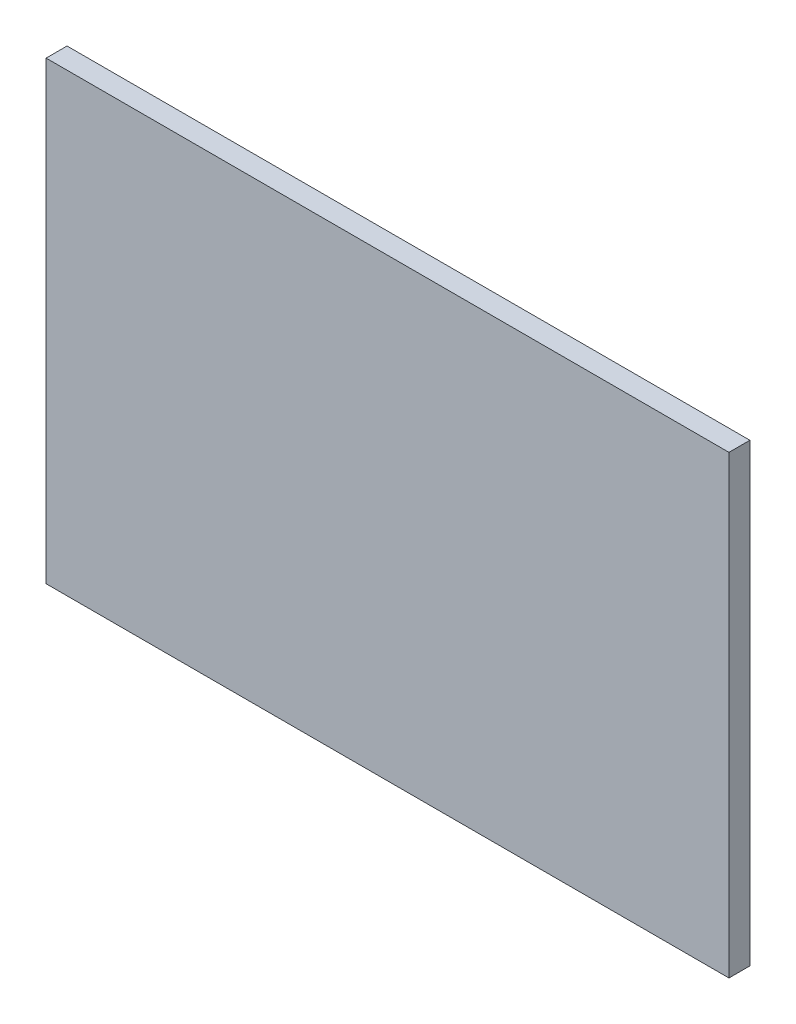
ISO-10303-21;
HEADER;
FILE_DESCRIPTION(('STEP AP214'),'2;1');
FILE_NAME('part.step','',(''),(''),'','','');
FILE_SCHEMA(('AUTOMOTIVE_DESIGN { 1 0 10303 214 1 1 1 1 }'));
ENDSEC;
DATA;
#1=APPLICATION_CONTEXT('core data for automotive mechanical design processes');
#2=APPLICATION_PROTOCOL_DEFINITION('international standard','automotive_design',2000,#1);
#3=PRODUCT_CONTEXT('',#1,'mechanical');
#4=PRODUCT('Part','Part','',(#3));
#5=PRODUCT_RELATED_PRODUCT_CATEGORY('part','',(#4));
#6=PRODUCT_DEFINITION_FORMATION('','',#4);
#7=PRODUCT_DEFINITION_CONTEXT('part definition',#1,'design');
#8=PRODUCT_DEFINITION('design','',#6,#7);
#9=PRODUCT_DEFINITION_SHAPE('','',#8);
#10=(LENGTH_UNIT() NAMED_UNIT(*) SI_UNIT(.MILLI.,.METRE.));
#11=(NAMED_UNIT(*) PLANE_ANGLE_UNIT() SI_UNIT($,.RADIAN.));
#12=(NAMED_UNIT(*) SI_UNIT($,.STERADIAN.) SOLID_ANGLE_UNIT());
#13=UNCERTAINTY_MEASURE_WITH_UNIT(LENGTH_MEASURE(1.E-05),#10,'distance_accuracy_value','');
#14=(GEOMETRIC_REPRESENTATION_CONTEXT(3) GLOBAL_UNCERTAINTY_ASSIGNED_CONTEXT((#13)) GLOBAL_UNIT_ASSIGNED_CONTEXT((#10,
#11,#12)) REPRESENTATION_CONTEXT('',''));
#15=CARTESIAN_POINT('',(0.,0.,0.));
#16=DIRECTION('',(0.,0.,1.));
#17=DIRECTION('',(1.,0.,0.));
#18=AXIS2_PLACEMENT_3D('',#15,#16,#17);
#19=CARTESIAN_POINT('',(0.,0.,0.));
#20=DIRECTION('',(0.,0.,1.));
#21=DIRECTION('',(1.,0.,0.));
#22=AXIS2_PLACEMENT_3D('',#19,#20,#21);
#23=PLANE('',#22);
#24=DIRECTION('',(1.,0.,0.));
#25=VECTOR('',#24,1.);
#26=CARTESIAN_POINT('',(179.729967884567,148.126483669053,0.));
#27=LINE('',#26,#25);
#28=CARTESIAN_POINT('',(179.729967884567,148.126483669053,0.));
#29=VERTEX_POINT('',#28);
#30=CARTESIAN_POINT('',(254.729967884567,148.126483669053,0.));
#31=VERTEX_POINT('',#30);
#32=EDGE_CURVE('E81',#29,#31,#27,.T.);
#33=ORIENTED_EDGE('',*,*,#32,.T.);
#34=DIRECTION('',(0.,1.,0.));
#35=VECTOR('',#34,1.);
#36=CARTESIAN_POINT('',(254.729967884567,148.126483669053,0.));
#37=LINE('',#36,#35);
#38=CARTESIAN_POINT('',(254.729967884567,98.1264836690532,0.));
#39=VERTEX_POINT('',#38);
#40=EDGE_CURVE('E68',#31,#39,#37,.F.);
#41=ORIENTED_EDGE('',*,*,#40,.T.);
#42=DIRECTION('',(1.,0.,0.));
#43=VECTOR('',#42,1.);
#44=CARTESIAN_POINT('',(179.729967884567,98.1264836690532,0.));
#45=LINE('',#44,#43);
#46=CARTESIAN_POINT('',(179.729967884567,98.1264836690532,0.));
#47=VERTEX_POINT('',#46);
#48=EDGE_CURVE('E55',#39,#47,#45,.F.);
#49=ORIENTED_EDGE('',*,*,#48,.T.);
#50=DIRECTION('',(0.,1.,0.));
#51=VECTOR('',#50,1.);
#52=CARTESIAN_POINT('',(179.729967884567,148.126483669053,0.));
#53=LINE('',#52,#51);
#54=EDGE_CURVE('E20',#47,#29,#53,.T.);
#55=ORIENTED_EDGE('',*,*,#54,.T.);
#56=EDGE_LOOP('',(#33,#41,#49,#55));
#57=FACE_BOUND('',#56,.T.);
#58=ADVANCED_FACE('F17',(#57),#23,.F.);
#59=CARTESIAN_POINT('',(179.729967884567,148.126483669053,2.3));
#60=DIRECTION('',(1.,0.,0.));
#61=DIRECTION('',(0.,0.,-1.));
#62=AXIS2_PLACEMENT_3D('',#59,#60,#61);
#63=PLANE('',#62);
#64=DIRECTION('',(0.,0.,1.));
#65=VECTOR('',#64,1.);
#66=CARTESIAN_POINT('',(179.729967884567,98.1264836690532,2.3));
#67=LINE('',#66,#65);
#68=CARTESIAN_POINT('',(179.729967884567,98.1264836690532,2.3));
#69=VERTEX_POINT('',#68);
#70=EDGE_CURVE('E61',#47,#69,#67,.T.);
#71=ORIENTED_EDGE('',*,*,#70,.T.);
#72=DIRECTION('',(0.,1.,0.));
#73=VECTOR('',#72,1.);
#74=CARTESIAN_POINT('',(179.729967884567,0.,2.3));
#75=LINE('',#74,#73);
#76=CARTESIAN_POINT('',(179.729967884567,148.126483669053,2.3));
#77=VERTEX_POINT('',#76);
#78=EDGE_CURVE('E83',#77,#69,#75,.F.);
#79=ORIENTED_EDGE('',*,*,#78,.F.);
#80=DIRECTION('',(0.,0.,1.));
#81=VECTOR('',#80,1.);
#82=CARTESIAN_POINT('',(179.729967884567,148.126483669053,2.3));
#83=LINE('',#82,#81);
#84=EDGE_CURVE('E64',#77,#29,#83,.F.);
#85=ORIENTED_EDGE('',*,*,#84,.T.);
#86=ORIENTED_EDGE('',*,*,#54,.F.);
#87=EDGE_LOOP('',(#71,#79,#85,#86));
#88=FACE_BOUND('',#87,.T.);
#89=ADVANCED_FACE('F60',(#88),#63,.F.);
#90=CARTESIAN_POINT('',(179.729967884567,98.1264836690532,2.3));
#91=DIRECTION('',(0.,1.,0.));
#92=DIRECTION('',(0.,0.,1.));
#93=AXIS2_PLACEMENT_3D('',#90,#91,#92);
#94=PLANE('',#93);
#95=DIRECTION('',(0.,0.,1.));
#96=VECTOR('',#95,1.);
#97=CARTESIAN_POINT('',(254.729967884567,98.1264836690532,2.3));
#98=LINE('',#97,#96);
#99=CARTESIAN_POINT('',(254.729967884567,98.1264836690532,2.3));
#100=VERTEX_POINT('',#99);
#101=EDGE_CURVE('E70',#39,#100,#98,.T.);
#102=ORIENTED_EDGE('',*,*,#101,.T.);
#103=DIRECTION('',(1.,0.,0.));
#104=VECTOR('',#103,1.);
#105=CARTESIAN_POINT('',(0.,98.1264836690532,2.3));
#106=LINE('',#105,#104);
#107=EDGE_CURVE('E74',#69,#100,#106,.T.);
#108=ORIENTED_EDGE('',*,*,#107,.F.);
#109=ORIENTED_EDGE('',*,*,#70,.F.);
#110=ORIENTED_EDGE('',*,*,#48,.F.);
#111=EDGE_LOOP('',(#102,#108,#109,#110));
#112=FACE_BOUND('',#111,.T.);
#113=ADVANCED_FACE('F72',(#112),#94,.F.);
#114=CARTESIAN_POINT('',(254.729967884567,148.126483669053,2.3));
#115=DIRECTION('',(-1.,0.,0.));
#116=DIRECTION('',(0.,0.,1.));
#117=AXIS2_PLACEMENT_3D('',#114,#115,#116);
#118=PLANE('',#117);
#119=DIRECTION('',(0.,0.,1.));
#120=VECTOR('',#119,1.);
#121=CARTESIAN_POINT('',(254.729967884567,148.126483669053,2.3));
#122=LINE('',#121,#120);
#123=CARTESIAN_POINT('',(254.729967884567,148.126483669053,2.3));
#124=VERTEX_POINT('',#123);
#125=EDGE_CURVE('E35',#31,#124,#122,.T.);
#126=ORIENTED_EDGE('',*,*,#125,.T.);
#127=DIRECTION('',(0.,1.,0.));
#128=VECTOR('',#127,1.);
#129=CARTESIAN_POINT('',(254.729967884567,0.,2.3));
#130=LINE('',#129,#128);
#131=EDGE_CURVE('E26',#100,#124,#130,.T.);
#132=ORIENTED_EDGE('',*,*,#131,.F.);
#133=ORIENTED_EDGE('',*,*,#101,.F.);
#134=ORIENTED_EDGE('',*,*,#40,.F.);
#135=EDGE_LOOP('',(#126,#132,#133,#134));
#136=FACE_BOUND('',#135,.T.);
#137=ADVANCED_FACE('F89',(#136),#118,.F.);
#138=CARTESIAN_POINT('',(179.729967884567,148.126483669053,2.3));
#139=DIRECTION('',(0.,-1.,0.));
#140=DIRECTION('',(1.,0.,0.));
#141=AXIS2_PLACEMENT_3D('',#138,#139,#140);
#142=PLANE('',#141);
#143=ORIENTED_EDGE('',*,*,#84,.F.);
#144=DIRECTION('',(1.,0.,0.));
#145=VECTOR('',#144,1.);
#146=CARTESIAN_POINT('',(0.,148.126483669053,2.3));
#147=LINE('',#146,#145);
#148=EDGE_CURVE('E10',#124,#77,#147,.F.);
#149=ORIENTED_EDGE('',*,*,#148,.F.);
#150=ORIENTED_EDGE('',*,*,#125,.F.);
#151=ORIENTED_EDGE('',*,*,#32,.F.);
#152=EDGE_LOOP('',(#143,#149,#150,#151));
#153=FACE_BOUND('',#152,.T.);
#154=ADVANCED_FACE('F91',(#153),#142,.F.);
#155=CARTESIAN_POINT('',(0.,0.,2.3));
#156=DIRECTION('',(0.,0.,1.));
#157=DIRECTION('',(1.,0.,0.));
#158=AXIS2_PLACEMENT_3D('',#155,#156,#157);
#159=PLANE('',#158);
#160=ORIENTED_EDGE('',*,*,#131,.T.);
#161=ORIENTED_EDGE('',*,*,#148,.T.);
#162=ORIENTED_EDGE('',*,*,#78,.T.);
#163=ORIENTED_EDGE('',*,*,#107,.T.);
#164=EDGE_LOOP('',(#160,#161,#162,#163));
#165=FACE_BOUND('',#164,.T.);
#166=ADVANCED_FACE('F88',(#165),#159,.T.);
#167=CLOSED_SHELL('',(#58,#89,#113,#137,#154,#166));
#168=MANIFOLD_SOLID_BREP('B1',#167);
#169=ADVANCED_BREP_SHAPE_REPRESENTATION('',(#18,#168),#14);
#170=SHAPE_DEFINITION_REPRESENTATION(#9,#169);
ENDSEC;
END-ISO-10303-21;
